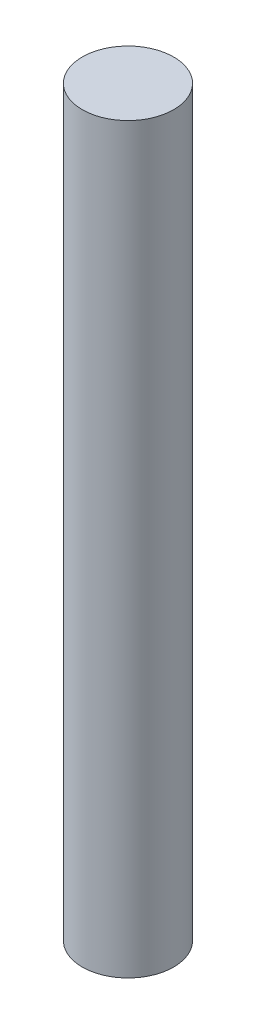
ISO-10303-21;
HEADER;
FILE_DESCRIPTION(('STEP AP214'),'2;1');
FILE_NAME('part.step','',(''),(''),'','','');
FILE_SCHEMA(('AUTOMOTIVE_DESIGN { 1 0 10303 214 1 1 1 1 }'));
ENDSEC;
DATA;
#1=APPLICATION_CONTEXT('core data for automotive mechanical design processes');
#2=APPLICATION_PROTOCOL_DEFINITION('international standard','automotive_design',2000,#1);
#3=PRODUCT_CONTEXT('',#1,'mechanical');
#4=PRODUCT('Part','Part','',(#3));
#5=PRODUCT_RELATED_PRODUCT_CATEGORY('part','',(#4));
#6=PRODUCT_DEFINITION_FORMATION('','',#4);
#7=PRODUCT_DEFINITION_CONTEXT('part definition',#1,'design');
#8=PRODUCT_DEFINITION('design','',#6,#7);
#9=PRODUCT_DEFINITION_SHAPE('','',#8);
#10=(LENGTH_UNIT() NAMED_UNIT(*) SI_UNIT(.MILLI.,.METRE.));
#11=(NAMED_UNIT(*) PLANE_ANGLE_UNIT() SI_UNIT($,.RADIAN.));
#12=(NAMED_UNIT(*) SI_UNIT($,.STERADIAN.) SOLID_ANGLE_UNIT());
#13=UNCERTAINTY_MEASURE_WITH_UNIT(LENGTH_MEASURE(1.E-05),#10,'distance_accuracy_value','');
#14=(GEOMETRIC_REPRESENTATION_CONTEXT(3) GLOBAL_UNCERTAINTY_ASSIGNED_CONTEXT((#13)) GLOBAL_UNIT_ASSIGNED_CONTEXT((#10,
#11,#12)) REPRESENTATION_CONTEXT('',''));
#15=CARTESIAN_POINT('',(0.,0.,0.));
#16=DIRECTION('',(0.,0.,1.));
#17=DIRECTION('',(1.,0.,0.));
#18=AXIS2_PLACEMENT_3D('',#15,#16,#17);
#19=CARTESIAN_POINT('',(0.,65.,0.));
#20=DIRECTION('',(0.,-1.,0.));
#21=DIRECTION('',(0.,0.,-1.));
#22=AXIS2_PLACEMENT_3D('',#19,#20,#21);
#23=CYLINDRICAL_SURFACE('',#22,4.);
#24=CARTESIAN_POINT('',(0.,65.,0.));
#25=DIRECTION('',(0.,1.,0.));
#26=DIRECTION('',(0.,0.,1.));
#27=AXIS2_PLACEMENT_3D('',#24,#25,#26);
#28=CIRCLE('',#27,4.);
#29=CARTESIAN_POINT('',(0.,65.,4.));
#30=VERTEX_POINT('',#29);
#31=EDGE_CURVE('E10',#30,#30,#28,.T.);
#32=ORIENTED_EDGE('',*,*,#31,.F.);
#33=EDGE_LOOP('',(#32));
#34=FACE_BOUND('',#33,.T.);
#35=CARTESIAN_POINT('',(0.,0.,0.));
#36=DIRECTION('',(0.,1.,0.));
#37=DIRECTION('',(0.,0.,1.));
#38=AXIS2_PLACEMENT_3D('',#35,#36,#37);
#39=CIRCLE('',#38,4.);
#40=CARTESIAN_POINT('',(0.,0.,4.));
#41=VERTEX_POINT('',#40);
#42=EDGE_CURVE('E44',#41,#41,#39,.T.);
#43=ORIENTED_EDGE('',*,*,#42,.T.);
#44=EDGE_LOOP('',(#43));
#45=FACE_BOUND('',#44,.T.);
#46=ADVANCED_FACE('F41',(#34,#45),#23,.T.);
#47=CARTESIAN_POINT('',(0.,65.,0.));
#48=DIRECTION('',(0.,1.,0.));
#49=DIRECTION('',(0.,0.,1.));
#50=AXIS2_PLACEMENT_3D('',#47,#48,#49);
#51=PLANE('',#50);
#52=ORIENTED_EDGE('',*,*,#31,.T.);
#53=EDGE_LOOP('',(#52));
#54=FACE_BOUND('',#53,.T.);
#55=ADVANCED_FACE('F58',(#54),#51,.T.);
#56=CARTESIAN_POINT('',(0.,0.,0.));
#57=DIRECTION('',(0.,1.,0.));
#58=DIRECTION('',(0.,0.,1.));
#59=AXIS2_PLACEMENT_3D('',#56,#57,#58);
#60=PLANE('',#59);
#61=ORIENTED_EDGE('',*,*,#42,.F.);
#62=EDGE_LOOP('',(#61));
#63=FACE_BOUND('',#62,.T.);
#64=ADVANCED_FACE('F56',(#63),#60,.F.);
#65=CLOSED_SHELL('',(#46,#55,#64));
#66=MANIFOLD_SOLID_BREP('B2',#65);
#67=ADVANCED_BREP_SHAPE_REPRESENTATION('',(#18,#66),#14);
#68=SHAPE_DEFINITION_REPRESENTATION(#9,#67);
ENDSEC;
END-ISO-10303-21;
